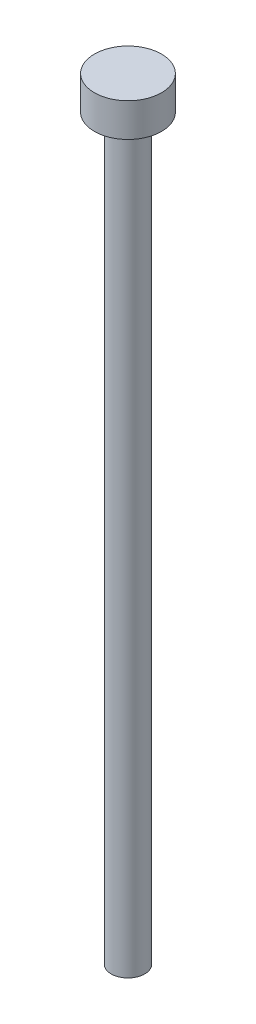
ISO-10303-21;
HEADER;
FILE_DESCRIPTION(('STEP AP214'),'2;1');
FILE_NAME('part.step','',(''),(''),'','','');
FILE_SCHEMA(('AUTOMOTIVE_DESIGN { 1 0 10303 214 1 1 1 1 }'));
ENDSEC;
DATA;
#1=APPLICATION_CONTEXT('core data for automotive mechanical design processes');
#2=APPLICATION_PROTOCOL_DEFINITION('international standard','automotive_design',2000,#1);
#3=PRODUCT_CONTEXT('',#1,'mechanical');
#4=PRODUCT('Part','Part','',(#3));
#5=PRODUCT_RELATED_PRODUCT_CATEGORY('part','',(#4));
#6=PRODUCT_DEFINITION_FORMATION('','',#4);
#7=PRODUCT_DEFINITION_CONTEXT('part definition',#1,'design');
#8=PRODUCT_DEFINITION('design','',#6,#7);
#9=PRODUCT_DEFINITION_SHAPE('','',#8);
#10=(LENGTH_UNIT() NAMED_UNIT(*) SI_UNIT(.MILLI.,.METRE.));
#11=(NAMED_UNIT(*) PLANE_ANGLE_UNIT() SI_UNIT($,.RADIAN.));
#12=(NAMED_UNIT(*) SI_UNIT($,.STERADIAN.) SOLID_ANGLE_UNIT());
#13=UNCERTAINTY_MEASURE_WITH_UNIT(LENGTH_MEASURE(1.E-05),#10,'distance_accuracy_value','');
#14=(GEOMETRIC_REPRESENTATION_CONTEXT(3) GLOBAL_UNCERTAINTY_ASSIGNED_CONTEXT((#13)) GLOBAL_UNIT_ASSIGNED_CONTEXT((#10,
#11,#12)) REPRESENTATION_CONTEXT('',''));
#15=CARTESIAN_POINT('',(0.,0.,0.));
#16=DIRECTION('',(0.,0.,1.));
#17=DIRECTION('',(1.,0.,0.));
#18=AXIS2_PLACEMENT_3D('',#15,#16,#17);
#19=CARTESIAN_POINT('',(0.,66.,0.));
#20=DIRECTION('',(0.,-1.,0.));
#21=DIRECTION('',(0.,0.,-1.));
#22=AXIS2_PLACEMENT_3D('',#19,#20,#21);
#23=CYLINDRICAL_SURFACE('',#22,1.5);
#24=CARTESIAN_POINT('',(0.,65.,0.));
#25=DIRECTION('',(0.,1.,0.));
#26=DIRECTION('',(0.,0.,1.));
#27=AXIS2_PLACEMENT_3D('',#24,#25,#26);
#28=CIRCLE('',#27,1.5);
#29=CARTESIAN_POINT('',(0.,65.,1.5));
#30=VERTEX_POINT('',#29);
#31=EDGE_CURVE('E10',#30,#30,#28,.F.);
#32=ORIENTED_EDGE('',*,*,#31,.T.);
#33=EDGE_LOOP('',(#32));
#34=FACE_BOUND('',#33,.T.);
#35=CARTESIAN_POINT('',(0.,0.,0.));
#36=DIRECTION('',(0.,1.,0.));
#37=DIRECTION('',(0.,0.,1.));
#38=AXIS2_PLACEMENT_3D('',#35,#36,#37);
#39=CIRCLE('',#38,1.5);
#40=CARTESIAN_POINT('',(0.,0.,1.5));
#41=VERTEX_POINT('',#40);
#42=EDGE_CURVE('E45',#41,#41,#39,.T.);
#43=ORIENTED_EDGE('',*,*,#42,.T.);
#44=EDGE_LOOP('',(#43));
#45=FACE_BOUND('',#44,.T.);
#46=ADVANCED_FACE('F34',(#34,#45),#23,.T.);
#47=CARTESIAN_POINT('',(0.,0.,0.));
#48=DIRECTION('',(0.,1.,0.));
#49=DIRECTION('',(0.,0.,1.));
#50=AXIS2_PLACEMENT_3D('',#47,#48,#49);
#51=PLANE('',#50);
#52=ORIENTED_EDGE('',*,*,#42,.F.);
#53=EDGE_LOOP('',(#52));
#54=FACE_BOUND('',#53,.T.);
#55=ADVANCED_FACE('F63',(#54),#51,.F.);
#56=CARTESIAN_POINT('',(0.,69.,0.));
#57=DIRECTION('',(0.,-1.,0.));
#58=DIRECTION('',(0.,0.,-1.));
#59=AXIS2_PLACEMENT_3D('',#56,#57,#58);
#60=CYLINDRICAL_SURFACE('',#59,3.);
#61=CARTESIAN_POINT('',(0.,69.,0.));
#62=DIRECTION('',(0.,1.,0.));
#63=DIRECTION('',(0.,0.,1.));
#64=AXIS2_PLACEMENT_3D('',#61,#62,#63);
#65=CIRCLE('',#64,3.);
#66=CARTESIAN_POINT('',(0.,69.,3.));
#67=VERTEX_POINT('',#66);
#68=EDGE_CURVE('E49',#67,#67,#65,.T.);
#69=ORIENTED_EDGE('',*,*,#68,.F.);
#70=EDGE_LOOP('',(#69));
#71=FACE_BOUND('',#70,.T.);
#72=CARTESIAN_POINT('',(0.,66.,0.));
#73=DIRECTION('',(0.,1.,0.));
#74=DIRECTION('',(0.,0.,1.));
#75=AXIS2_PLACEMENT_3D('',#72,#73,#74);
#76=CIRCLE('',#75,3.);
#77=CARTESIAN_POINT('',(0.,66.,3.));
#78=VERTEX_POINT('',#77);
#79=EDGE_CURVE('E52',#78,#78,#76,.T.);
#80=ORIENTED_EDGE('',*,*,#79,.T.);
#81=EDGE_LOOP('',(#80));
#82=FACE_BOUND('',#81,.T.);
#83=ADVANCED_FACE('F60',(#71,#82),#60,.T.);
#84=CARTESIAN_POINT('',(0.,69.,0.));
#85=DIRECTION('',(0.,1.,0.));
#86=DIRECTION('',(0.,0.,1.));
#87=AXIS2_PLACEMENT_3D('',#84,#85,#86);
#88=PLANE('',#87);
#89=ORIENTED_EDGE('',*,*,#68,.T.);
#90=EDGE_LOOP('',(#89));
#91=FACE_BOUND('',#90,.T.);
#92=ADVANCED_FACE('F58',(#91),#88,.T.);
#93=CARTESIAN_POINT('',(0.,66.,0.));
#94=DIRECTION('',(0.,1.,0.));
#95=DIRECTION('',(0.,0.,1.));
#96=AXIS2_PLACEMENT_3D('',#93,#94,#95);
#97=PLANE('',#96);
#98=CARTESIAN_POINT('',(0.,66.,0.));
#99=DIRECTION('',(0.,1.,0.));
#100=DIRECTION('',(0.,0.,1.));
#101=AXIS2_PLACEMENT_3D('',#98,#99,#100);
#102=CIRCLE('',#101,2.5);
#103=CARTESIAN_POINT('',(0.,66.,2.5));
#104=VERTEX_POINT('',#103);
#105=EDGE_CURVE('E41',#104,#104,#102,.T.);
#106=ORIENTED_EDGE('',*,*,#105,.T.);
#107=EDGE_LOOP('',(#106));
#108=FACE_BOUND('',#107,.T.);
#109=ORIENTED_EDGE('',*,*,#79,.F.);
#110=EDGE_LOOP('',(#109));
#111=FACE_BOUND('',#110,.T.);
#112=ADVANCED_FACE('F67',(#108,#111),#97,.F.);
#113=CARTESIAN_POINT('',(0.,65.,0.));
#114=DIRECTION('',(0.,1.,0.));
#115=DIRECTION('',(0.,0.,1.));
#116=AXIS2_PLACEMENT_3D('',#113,#114,#115);
#117=TOROIDAL_SURFACE('',#116,2.5,1.);
#118=ORIENTED_EDGE('',*,*,#31,.F.);
#119=EDGE_LOOP('',(#118));
#120=FACE_BOUND('',#119,.T.);
#121=ORIENTED_EDGE('',*,*,#105,.F.);
#122=EDGE_LOOP('',(#121));
#123=FACE_BOUND('',#122,.T.);
#124=ADVANCED_FACE('F36',(#120,#123),#117,.F.);
#125=CLOSED_SHELL('',(#46,#55,#83,#92,#112,#124));
#126=MANIFOLD_SOLID_BREP('B2',#125);
#127=ADVANCED_BREP_SHAPE_REPRESENTATION('',(#18,#126),#14);
#128=SHAPE_DEFINITION_REPRESENTATION(#9,#127);
ENDSEC;
END-ISO-10303-21;
